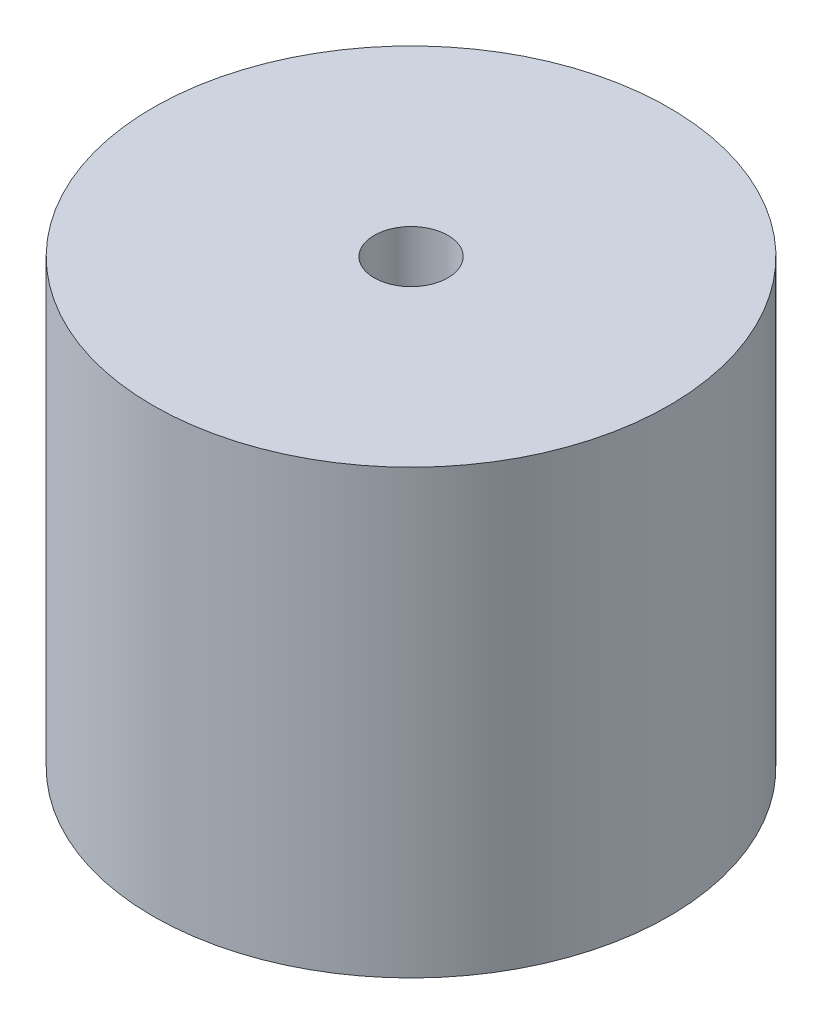
ISO-10303-21;
HEADER;
FILE_DESCRIPTION(('STEP AP214'),'2;1');
FILE_NAME('part.step','',(''),(''),'','','');
FILE_SCHEMA(('AUTOMOTIVE_DESIGN { 1 0 10303 214 1 1 1 1 }'));
ENDSEC;
DATA;
#1=APPLICATION_CONTEXT('core data for automotive mechanical design processes');
#2=APPLICATION_PROTOCOL_DEFINITION('international standard','automotive_design',2000,#1);
#3=PRODUCT_CONTEXT('',#1,'mechanical');
#4=PRODUCT('Part','Part','',(#3));
#5=PRODUCT_RELATED_PRODUCT_CATEGORY('part','',(#4));
#6=PRODUCT_DEFINITION_FORMATION('','',#4);
#7=PRODUCT_DEFINITION_CONTEXT('part definition',#1,'design');
#8=PRODUCT_DEFINITION('design','',#6,#7);
#9=PRODUCT_DEFINITION_SHAPE('','',#8);
#10=(LENGTH_UNIT() NAMED_UNIT(*) SI_UNIT(.MILLI.,.METRE.));
#11=(NAMED_UNIT(*) PLANE_ANGLE_UNIT() SI_UNIT($,.RADIAN.));
#12=(NAMED_UNIT(*) SI_UNIT($,.STERADIAN.) SOLID_ANGLE_UNIT());
#13=UNCERTAINTY_MEASURE_WITH_UNIT(LENGTH_MEASURE(1.E-05),#10,'distance_accuracy_value','');
#14=(GEOMETRIC_REPRESENTATION_CONTEXT(3) GLOBAL_UNCERTAINTY_ASSIGNED_CONTEXT((#13)) GLOBAL_UNIT_ASSIGNED_CONTEXT((#10,
#11,#12)) REPRESENTATION_CONTEXT('',''));
#15=CARTESIAN_POINT('',(0.,0.,0.));
#16=DIRECTION('',(0.,0.,1.));
#17=DIRECTION('',(1.,0.,0.));
#18=AXIS2_PLACEMENT_3D('',#15,#16,#17);
#19=CARTESIAN_POINT('',(0.,38.1,0.));
#20=DIRECTION('',(0.,1.,0.));
#21=DIRECTION('',(0.,0.,1.));
#22=AXIS2_PLACEMENT_3D('',#19,#20,#21);
#23=PLANE('',#22);
#24=CARTESIAN_POINT('',(0.,38.1,0.));
#25=DIRECTION('',(0.,1.,0.));
#26=DIRECTION('',(0.,0.,1.));
#27=AXIS2_PLACEMENT_3D('',#24,#25,#26);
#28=CIRCLE('',#27,22.225);
#29=CARTESIAN_POINT('',(0.,38.1,22.225));
#30=VERTEX_POINT('',#29);
#31=EDGE_CURVE('E10',#30,#30,#28,.T.);
#32=ORIENTED_EDGE('',*,*,#31,.T.);
#33=EDGE_LOOP('',(#32));
#34=FACE_BOUND('',#33,.T.);
#35=CARTESIAN_POINT('',(0.,38.1,0.));
#36=DIRECTION('',(0.,1.,0.));
#37=DIRECTION('',(0.,0.,1.));
#38=AXIS2_PLACEMENT_3D('',#35,#36,#37);
#39=CIRCLE('',#38,3.175);
#40=CARTESIAN_POINT('',(0.,38.1,3.175));
#41=VERTEX_POINT('',#40);
#42=EDGE_CURVE('E44',#41,#41,#39,.T.);
#43=ORIENTED_EDGE('',*,*,#42,.F.);
#44=EDGE_LOOP('',(#43));
#45=FACE_BOUND('',#44,.T.);
#46=ADVANCED_FACE('F33',(#34,#45),#23,.T.);
#47=CARTESIAN_POINT('',(0.,0.,0.));
#48=DIRECTION('',(0.,1.,0.));
#49=DIRECTION('',(0.,0.,1.));
#50=AXIS2_PLACEMENT_3D('',#47,#48,#49);
#51=PLANE('',#50);
#52=CARTESIAN_POINT('',(0.,0.,0.));
#53=DIRECTION('',(0.,1.,0.));
#54=DIRECTION('',(0.,0.,1.));
#55=AXIS2_PLACEMENT_3D('',#52,#53,#54);
#56=CIRCLE('',#55,22.225);
#57=CARTESIAN_POINT('',(0.,0.,22.225));
#58=VERTEX_POINT('',#57);
#59=EDGE_CURVE('E37',#58,#58,#56,.T.);
#60=ORIENTED_EDGE('',*,*,#59,.F.);
#61=EDGE_LOOP('',(#60));
#62=FACE_BOUND('',#61,.T.);
#63=CARTESIAN_POINT('',(0.,0.,0.));
#64=DIRECTION('',(0.,1.,0.));
#65=DIRECTION('',(0.,0.,1.));
#66=AXIS2_PLACEMENT_3D('',#63,#64,#65);
#67=CIRCLE('',#66,3.175);
#68=CARTESIAN_POINT('',(0.,0.,3.175));
#69=VERTEX_POINT('',#68);
#70=EDGE_CURVE('E46',#69,#69,#67,.T.);
#71=ORIENTED_EDGE('',*,*,#70,.T.);
#72=EDGE_LOOP('',(#71));
#73=FACE_BOUND('',#72,.T.);
#74=ADVANCED_FACE('F56',(#62,#73),#51,.F.);
#75=CARTESIAN_POINT('',(0.,38.1,0.));
#76=DIRECTION('',(0.,-1.,0.));
#77=DIRECTION('',(0.,0.,-1.));
#78=AXIS2_PLACEMENT_3D('',#75,#76,#77);
#79=CYLINDRICAL_SURFACE('',#78,22.225);
#80=ORIENTED_EDGE('',*,*,#31,.F.);
#81=EDGE_LOOP('',(#80));
#82=FACE_BOUND('',#81,.T.);
#83=ORIENTED_EDGE('',*,*,#59,.T.);
#84=EDGE_LOOP('',(#83));
#85=FACE_BOUND('',#84,.T.);
#86=ADVANCED_FACE('F35',(#82,#85),#79,.T.);
#87=CARTESIAN_POINT('',(0.,38.1,0.));
#88=DIRECTION('',(0.,-1.,0.));
#89=DIRECTION('',(0.,0.,-1.));
#90=AXIS2_PLACEMENT_3D('',#87,#88,#89);
#91=CYLINDRICAL_SURFACE('',#90,3.175);
#92=ORIENTED_EDGE('',*,*,#42,.T.);
#93=EDGE_LOOP('',(#92));
#94=FACE_BOUND('',#93,.T.);
#95=ORIENTED_EDGE('',*,*,#70,.F.);
#96=EDGE_LOOP('',(#95));
#97=FACE_BOUND('',#96,.T.);
#98=ADVANCED_FACE('F52',(#94,#97),#91,.F.);
#99=CLOSED_SHELL('',(#46,#74,#86,#98));
#100=MANIFOLD_SOLID_BREP('B2',#99);
#101=ADVANCED_BREP_SHAPE_REPRESENTATION('',(#18,#100),#14);
#102=SHAPE_DEFINITION_REPRESENTATION(#9,#101);
ENDSEC;
END-ISO-10303-21;
